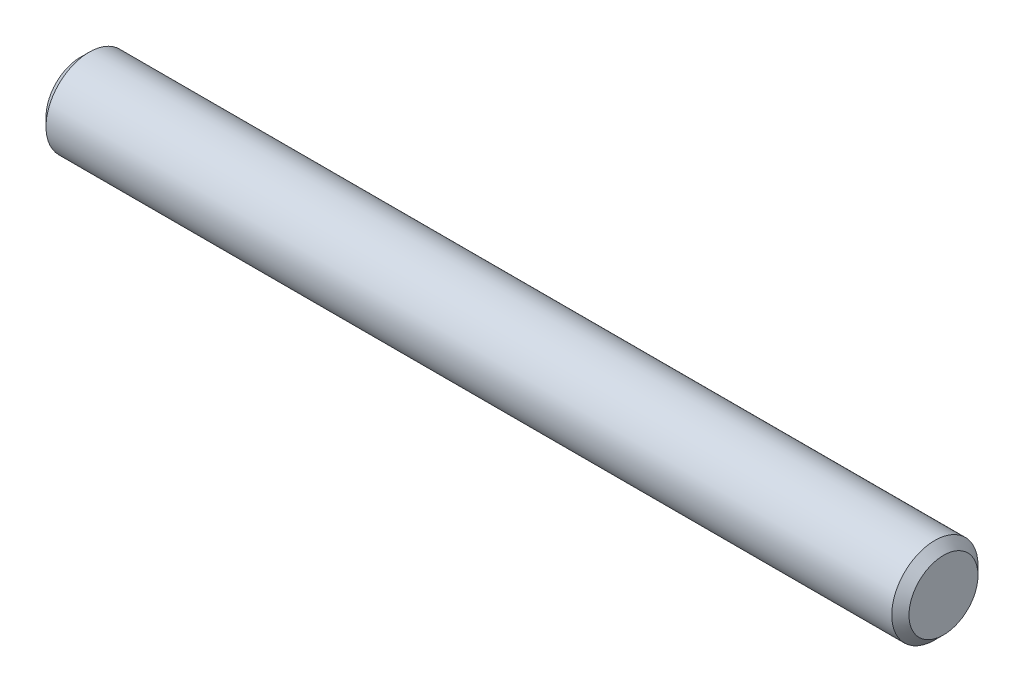
ISO-10303-21;
HEADER;
FILE_DESCRIPTION(('STEP AP214'),'2;1');
FILE_NAME('part.step','',(''),(''),'','','');
FILE_SCHEMA(('AUTOMOTIVE_DESIGN { 1 0 10303 214 1 1 1 1 }'));
ENDSEC;
DATA;
#1=APPLICATION_CONTEXT('core data for automotive mechanical design processes');
#2=APPLICATION_PROTOCOL_DEFINITION('international standard','automotive_design',2000,#1);
#3=PRODUCT_CONTEXT('',#1,'mechanical');
#4=PRODUCT('Part','Part','',(#3));
#5=PRODUCT_RELATED_PRODUCT_CATEGORY('part','',(#4));
#6=PRODUCT_DEFINITION_FORMATION('','',#4);
#7=PRODUCT_DEFINITION_CONTEXT('part definition',#1,'design');
#8=PRODUCT_DEFINITION('design','',#6,#7);
#9=PRODUCT_DEFINITION_SHAPE('','',#8);
#10=(LENGTH_UNIT() NAMED_UNIT(*) SI_UNIT(.MILLI.,.METRE.));
#11=(NAMED_UNIT(*) PLANE_ANGLE_UNIT() SI_UNIT($,.RADIAN.));
#12=(NAMED_UNIT(*) SI_UNIT($,.STERADIAN.) SOLID_ANGLE_UNIT());
#13=UNCERTAINTY_MEASURE_WITH_UNIT(LENGTH_MEASURE(1.E-05),#10,'distance_accuracy_value','');
#14=(GEOMETRIC_REPRESENTATION_CONTEXT(3) GLOBAL_UNCERTAINTY_ASSIGNED_CONTEXT((#13)) GLOBAL_UNIT_ASSIGNED_CONTEXT((#10,
#11,#12)) REPRESENTATION_CONTEXT('',''));
#15=CARTESIAN_POINT('',(0.,0.,0.));
#16=DIRECTION('',(0.,0.,1.));
#17=DIRECTION('',(1.,0.,0.));
#18=AXIS2_PLACEMENT_3D('',#15,#16,#17);
#19=CARTESIAN_POINT('',(-31.75,0.,0.));
#20=DIRECTION('',(1.,0.,0.));
#21=DIRECTION('',(0.,0.,-1.));
#22=AXIS2_PLACEMENT_3D('',#19,#20,#21);
#23=CYLINDRICAL_SURFACE('',#22,3.175);
#24=CARTESIAN_POINT('',(31.115,0.,0.));
#25=DIRECTION('',(1.,0.,0.));
#26=DIRECTION('',(0.,0.,-1.));
#27=AXIS2_PLACEMENT_3D('',#24,#25,#26);
#28=CIRCLE('',#27,3.175);
#29=CARTESIAN_POINT('',(31.115,0.,-3.175));
#30=VERTEX_POINT('',#29);
#31=EDGE_CURVE('E37',#30,#30,#28,.F.);
#32=ORIENTED_EDGE('',*,*,#31,.T.);
#33=EDGE_LOOP('',(#32));
#34=FACE_BOUND('',#33,.T.);
#35=CARTESIAN_POINT('',(-31.115,0.,0.));
#36=DIRECTION('',(1.,0.,0.));
#37=DIRECTION('',(0.,0.,-1.));
#38=AXIS2_PLACEMENT_3D('',#35,#36,#37);
#39=CIRCLE('',#38,3.175);
#40=CARTESIAN_POINT('',(-31.115,0.,-3.175));
#41=VERTEX_POINT('',#40);
#42=EDGE_CURVE('E41',#41,#41,#39,.T.);
#43=ORIENTED_EDGE('',*,*,#42,.T.);
#44=EDGE_LOOP('',(#43));
#45=FACE_BOUND('',#44,.T.);
#46=ADVANCED_FACE('F30',(#34,#45),#23,.T.);
#47=CARTESIAN_POINT('',(-31.75,0.,0.));
#48=DIRECTION('',(1.,0.,0.));
#49=DIRECTION('',(0.,0.,-1.));
#50=AXIS2_PLACEMENT_3D('',#47,#48,#49);
#51=PLANE('',#50);
#52=CARTESIAN_POINT('',(-31.75,0.,0.));
#53=DIRECTION('',(1.,0.,0.));
#54=DIRECTION('',(0.,0.,-1.));
#55=AXIS2_PLACEMENT_3D('',#52,#53,#54);
#56=CIRCLE('',#55,2.54);
#57=CARTESIAN_POINT('',(-31.75,0.,-2.54));
#58=VERTEX_POINT('',#57);
#59=EDGE_CURVE('E10',#58,#58,#56,.F.);
#60=ORIENTED_EDGE('',*,*,#59,.T.);
#61=EDGE_LOOP('',(#60));
#62=FACE_BOUND('',#61,.T.);
#63=ADVANCED_FACE('F61',(#62),#51,.F.);
#64=CARTESIAN_POINT('',(31.75,0.,0.));
#65=DIRECTION('',(1.,0.,0.));
#66=DIRECTION('',(0.,0.,-1.));
#67=AXIS2_PLACEMENT_3D('',#64,#65,#66);
#68=PLANE('',#67);
#69=CARTESIAN_POINT('',(31.75,0.,0.));
#70=DIRECTION('',(1.,0.,0.));
#71=DIRECTION('',(0.,0.,-1.));
#72=AXIS2_PLACEMENT_3D('',#69,#70,#71);
#73=CIRCLE('',#72,2.53999999999999);
#74=CARTESIAN_POINT('',(31.75,0.,-2.53999999999999));
#75=VERTEX_POINT('',#74);
#76=EDGE_CURVE('E45',#75,#75,#73,.T.);
#77=ORIENTED_EDGE('',*,*,#76,.T.);
#78=EDGE_LOOP('',(#77));
#79=FACE_BOUND('',#78,.T.);
#80=ADVANCED_FACE('F51',(#79),#68,.T.);
#81=CARTESIAN_POINT('',(31.75,0.,0.));
#82=DIRECTION('',(-1.,0.,0.));
#83=DIRECTION('',(0.,0.,1.));
#84=AXIS2_PLACEMENT_3D('',#81,#82,#83);
#85=CONICAL_SURFACE('',#84,2.53999999999999,0.785398163397445);
#86=ORIENTED_EDGE('',*,*,#31,.F.);
#87=EDGE_LOOP('',(#86));
#88=FACE_BOUND('',#87,.T.);
#89=ORIENTED_EDGE('',*,*,#76,.F.);
#90=EDGE_LOOP('',(#89));
#91=FACE_BOUND('',#90,.T.);
#92=ADVANCED_FACE('F53',(#88,#91),#85,.T.);
#93=CARTESIAN_POINT('',(-31.115,0.,0.));
#94=DIRECTION('',(1.,0.,0.));
#95=DIRECTION('',(0.,0.,-1.));
#96=AXIS2_PLACEMENT_3D('',#93,#94,#95);
#97=CONICAL_SURFACE('',#96,3.175,0.78539816339745);
#98=ORIENTED_EDGE('',*,*,#59,.F.);
#99=EDGE_LOOP('',(#98));
#100=FACE_BOUND('',#99,.T.);
#101=ORIENTED_EDGE('',*,*,#42,.F.);
#102=EDGE_LOOP('',(#101));
#103=FACE_BOUND('',#102,.T.);
#104=ADVANCED_FACE('F32',(#100,#103),#97,.T.);
#105=CLOSED_SHELL('',(#46,#63,#80,#92,#104));
#106=MANIFOLD_SOLID_BREP('B2',#105);
#107=ADVANCED_BREP_SHAPE_REPRESENTATION('',(#18,#106),#14);
#108=SHAPE_DEFINITION_REPRESENTATION(#9,#107);
ENDSEC;
END-ISO-10303-21;
